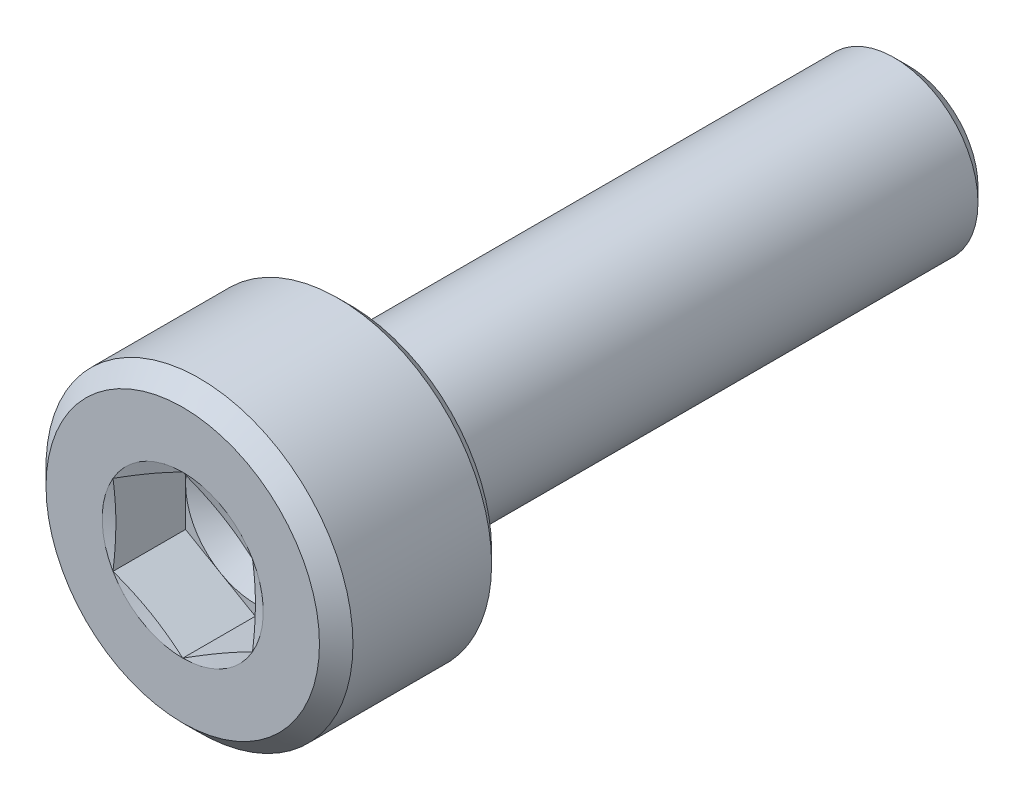
ISO-10303-21;
HEADER;
FILE_DESCRIPTION(('STEP AP214'),'2;1');
FILE_NAME('part.step','',(''),(''),'','','');
FILE_SCHEMA(('AUTOMOTIVE_DESIGN { 1 0 10303 214 1 1 1 1 }'));
ENDSEC;
DATA;
#1=APPLICATION_CONTEXT('core data for automotive mechanical design processes');
#2=APPLICATION_PROTOCOL_DEFINITION('international standard','automotive_design',2000,#1);
#3=PRODUCT_CONTEXT('',#1,'mechanical');
#4=PRODUCT('Part','Part','',(#3));
#5=PRODUCT_RELATED_PRODUCT_CATEGORY('part','',(#4));
#6=PRODUCT_DEFINITION_FORMATION('','',#4);
#7=PRODUCT_DEFINITION_CONTEXT('part definition',#1,'design');
#8=PRODUCT_DEFINITION('design','',#6,#7);
#9=PRODUCT_DEFINITION_SHAPE('','',#8);
#10=(LENGTH_UNIT() NAMED_UNIT(*) SI_UNIT(.MILLI.,.METRE.));
#11=(NAMED_UNIT(*) PLANE_ANGLE_UNIT() SI_UNIT($,.RADIAN.));
#12=(NAMED_UNIT(*) SI_UNIT($,.STERADIAN.) SOLID_ANGLE_UNIT());
#13=UNCERTAINTY_MEASURE_WITH_UNIT(LENGTH_MEASURE(1.E-05),#10,'distance_accuracy_value','');
#14=(GEOMETRIC_REPRESENTATION_CONTEXT(3) GLOBAL_UNCERTAINTY_ASSIGNED_CONTEXT((#13)) GLOBAL_UNIT_ASSIGNED_CONTEXT((#10,
#11,#12)) REPRESENTATION_CONTEXT('',''));
#15=CARTESIAN_POINT('',(0.,0.,0.));
#16=DIRECTION('',(0.,0.,1.));
#17=DIRECTION('',(1.,0.,0.));
#18=AXIS2_PLACEMENT_3D('',#15,#16,#17);
#19=CARTESIAN_POINT('',(0.,0.,0.));
#20=DIRECTION('',(0.,0.,-1.));
#21=DIRECTION('',(-1.,0.,0.));
#22=AXIS2_PLACEMENT_3D('',#19,#20,#21);
#23=PLANE('',#22);
#24=CARTESIAN_POINT('',(0.,0.,0.));
#25=DIRECTION('',(0.,0.,1.));
#26=DIRECTION('',(1.,0.,0.));
#27=AXIS2_PLACEMENT_3D('',#24,#25,#26);
#28=CIRCLE('',#27,2.44999999999999);
#29=CARTESIAN_POINT('',(2.44999999999999,0.,0.));
#30=VERTEX_POINT('',#29);
#31=EDGE_CURVE('E230',#30,#30,#28,.T.);
#32=ORIENTED_EDGE('',*,*,#31,.T.);
#33=EDGE_LOOP('',(#32));
#34=FACE_BOUND('',#33,.T.);
#35=CARTESIAN_POINT('',(0.,0.,0.));
#36=DIRECTION('',(0.,0.,1.));
#37=DIRECTION('',(1.,0.,0.));
#38=AXIS2_PLACEMENT_3D('',#35,#36,#37);
#39=CIRCLE('',#38,1.44337567297407);
#40=CARTESIAN_POINT('',(-1.25,-0.721687836487033,0.));
#41=VERTEX_POINT('',#40);
#42=CARTESIAN_POINT('',(0.,-1.44337567297407,0.));
#43=VERTEX_POINT('',#42);
#44=EDGE_CURVE('E156',#41,#43,#39,.T.);
#45=ORIENTED_EDGE('',*,*,#44,.F.);
#46=CARTESIAN_POINT('',(-1.25,0.721687836487033,0.));
#47=VERTEX_POINT('',#46);
#48=EDGE_CURVE('E155',#47,#41,#39,.T.);
#49=ORIENTED_EDGE('',*,*,#48,.F.);
#50=CARTESIAN_POINT('',(0.,1.44337567297407,0.));
#51=VERTEX_POINT('',#50);
#52=EDGE_CURVE('E122',#51,#47,#39,.T.);
#53=ORIENTED_EDGE('',*,*,#52,.F.);
#54=CARTESIAN_POINT('',(1.25,0.721687836487034,0.));
#55=VERTEX_POINT('',#54);
#56=EDGE_CURVE('E116',#55,#51,#39,.T.);
#57=ORIENTED_EDGE('',*,*,#56,.F.);
#58=CARTESIAN_POINT('',(1.25,-0.721687836487031,0.));
#59=VERTEX_POINT('',#58);
#60=EDGE_CURVE('E124',#59,#55,#39,.T.);
#61=ORIENTED_EDGE('',*,*,#60,.F.);
#62=EDGE_CURVE('E314',#43,#59,#39,.T.);
#63=ORIENTED_EDGE('',*,*,#62,.F.);
#64=EDGE_LOOP('',(#45,#49,#53,#57,#61,#63));
#65=FACE_BOUND('',#64,.T.);
#66=ADVANCED_FACE('F39',(#34,#65),#23,.F.);
#67=CARTESIAN_POINT('',(0.,0.,-0.3));
#68=DIRECTION('',(0.,0.,-1.));
#69=DIRECTION('',(-1.,0.,0.));
#70=AXIS2_PLACEMENT_3D('',#67,#68,#69);
#71=CONICAL_SURFACE('',#70,2.75,0.78539816339746);
#72=ORIENTED_EDGE('',*,*,#31,.F.);
#73=EDGE_LOOP('',(#72));
#74=FACE_BOUND('',#73,.T.);
#75=CARTESIAN_POINT('',(0.,0.,-0.3));
#76=DIRECTION('',(0.,0.,1.));
#77=DIRECTION('',(1.,0.,0.));
#78=AXIS2_PLACEMENT_3D('',#75,#76,#77);
#79=CIRCLE('',#78,2.75);
#80=CARTESIAN_POINT('',(2.75,0.,-0.3));
#81=VERTEX_POINT('',#80);
#82=EDGE_CURVE('E232',#81,#81,#79,.T.);
#83=ORIENTED_EDGE('',*,*,#82,.T.);
#84=EDGE_LOOP('',(#83));
#85=FACE_BOUND('',#84,.T.);
#86=ADVANCED_FACE('F221',(#74,#85),#71,.T.);
#87=CARTESIAN_POINT('',(0.,0.,0.));
#88=DIRECTION('',(0.,0.,1.));
#89=DIRECTION('',(1.,0.,0.));
#90=AXIS2_PLACEMENT_3D('',#87,#88,#89);
#91=CYLINDRICAL_SURFACE('',#90,2.75);
#92=ORIENTED_EDGE('',*,*,#82,.F.);
#93=EDGE_LOOP('',(#92));
#94=FACE_BOUND('',#93,.T.);
#95=CARTESIAN_POINT('',(0.,0.,-2.785));
#96=DIRECTION('',(0.,0.,1.));
#97=DIRECTION('',(1.,0.,0.));
#98=AXIS2_PLACEMENT_3D('',#95,#96,#97);
#99=CIRCLE('',#98,2.75);
#100=CARTESIAN_POINT('',(2.75,0.,-2.785));
#101=VERTEX_POINT('',#100);
#102=EDGE_CURVE('E235',#101,#101,#99,.T.);
#103=ORIENTED_EDGE('',*,*,#102,.T.);
#104=EDGE_LOOP('',(#103));
#105=FACE_BOUND('',#104,.T.);
#106=ADVANCED_FACE('F226',(#94,#105),#91,.T.);
#107=CARTESIAN_POINT('',(0.,0.,-3.));
#108=DIRECTION('',(0.,0.,1.));
#109=DIRECTION('',(1.,0.,0.));
#110=AXIS2_PLACEMENT_3D('',#107,#108,#109);
#111=CONICAL_SURFACE('',#110,2.535,0.785398163397449);
#112=ORIENTED_EDGE('',*,*,#102,.F.);
#113=EDGE_LOOP('',(#112));
#114=FACE_BOUND('',#113,.T.);
#115=CARTESIAN_POINT('',(0.,0.,-3.));
#116=DIRECTION('',(0.,0.,1.));
#117=DIRECTION('',(1.,0.,0.));
#118=AXIS2_PLACEMENT_3D('',#115,#116,#117);
#119=CIRCLE('',#118,2.535);
#120=CARTESIAN_POINT('',(2.535,0.,-3.));
#121=VERTEX_POINT('',#120);
#122=EDGE_CURVE('E240',#121,#121,#119,.T.);
#123=ORIENTED_EDGE('',*,*,#122,.T.);
#124=EDGE_LOOP('',(#123));
#125=FACE_BOUND('',#124,.T.);
#126=ADVANCED_FACE('F430',(#114,#125),#111,.T.);
#127=CARTESIAN_POINT('',(0.,2.535,-3.));
#128=DIRECTION('',(0.,0.,1.));
#129=DIRECTION('',(1.,0.,0.));
#130=AXIS2_PLACEMENT_3D('',#127,#128,#129);
#131=PLANE('',#130);
#132=ORIENTED_EDGE('',*,*,#122,.F.);
#133=EDGE_LOOP('',(#132));
#134=FACE_BOUND('',#133,.T.);
#135=CARTESIAN_POINT('',(0.,0.,-3.));
#136=DIRECTION('',(0.,0.,1.));
#137=DIRECTION('',(1.,0.,0.));
#138=AXIS2_PLACEMENT_3D('',#135,#136,#137);
#139=CIRCLE('',#138,1.8);
#140=CARTESIAN_POINT('',(1.8,0.,-3.));
#141=VERTEX_POINT('',#140);
#142=EDGE_CURVE('E243',#141,#141,#139,.T.);
#143=ORIENTED_EDGE('',*,*,#142,.T.);
#144=EDGE_LOOP('',(#143));
#145=FACE_BOUND('',#144,.T.);
#146=ADVANCED_FACE('F422',(#134,#145),#131,.F.);
#147=CARTESIAN_POINT('',(0.,0.,-3.1));
#148=DIRECTION('',(0.,0.,1.));
#149=DIRECTION('',(1.,0.,0.));
#150=AXIS2_PLACEMENT_3D('',#147,#148,#149);
#151=TOROIDAL_SURFACE('',#150,1.8,0.1);
#152=ORIENTED_EDGE('',*,*,#142,.F.);
#153=EDGE_LOOP('',(#152));
#154=FACE_BOUND('',#153,.T.);
#155=CARTESIAN_POINT('',(0.,0.,-3.05615763679786));
#156=DIRECTION('',(0.,0.,1.));
#157=DIRECTION('',(1.,0.,0.));
#158=AXIS2_PLACEMENT_3D('',#155,#156,#157);
#159=CIRCLE('',#158,1.71012315543561);
#160=CARTESIAN_POINT('',(1.71012315543561,0.,-3.05615763679786));
#161=VERTEX_POINT('',#160);
#162=EDGE_CURVE('E246',#161,#161,#159,.T.);
#163=ORIENTED_EDGE('',*,*,#162,.T.);
#164=EDGE_LOOP('',(#163));
#165=FACE_BOUND('',#164,.T.);
#166=ADVANCED_FACE('F414',(#154,#165),#151,.F.);
#167=CARTESIAN_POINT('',(0.,0.,-3.46615763679786));
#168=DIRECTION('',(0.,0.,1.));
#169=DIRECTION('',(1.,0.,0.));
#170=AXIS2_PLACEMENT_3D('',#167,#168,#169);
#171=CONICAL_SURFACE('',#170,1.51012315543561,0.453844001521511);
#172=ORIENTED_EDGE('',*,*,#162,.F.);
#173=EDGE_LOOP('',(#172));
#174=FACE_BOUND('',#173,.T.);
#175=CARTESIAN_POINT('',(0.,0.,-3.46615763679786));
#176=DIRECTION('',(0.,0.,1.));
#177=DIRECTION('',(1.,0.,0.));
#178=AXIS2_PLACEMENT_3D('',#175,#176,#177);
#179=CIRCLE('',#178,1.51012315543561);
#180=CARTESIAN_POINT('',(1.51012315543561,0.,-3.46615763679786));
#181=VERTEX_POINT('',#180);
#182=EDGE_CURVE('E249',#181,#181,#179,.T.);
#183=ORIENTED_EDGE('',*,*,#182,.T.);
#184=EDGE_LOOP('',(#183));
#185=FACE_BOUND('',#184,.T.);
#186=ADVANCED_FACE('F406',(#174,#185),#171,.T.);
#187=CARTESIAN_POINT('',(0.,0.,-3.51));
#188=DIRECTION('',(0.,0.,1.));
#189=DIRECTION('',(1.,0.,0.));
#190=AXIS2_PLACEMENT_3D('',#187,#188,#189);
#191=TOROIDAL_SURFACE('',#190,1.6,0.1);
#192=ORIENTED_EDGE('',*,*,#182,.F.);
#193=EDGE_LOOP('',(#192));
#194=FACE_BOUND('',#193,.T.);
#195=CARTESIAN_POINT('',(0.,0.,-3.51));
#196=DIRECTION('',(0.,0.,1.));
#197=DIRECTION('',(1.,0.,0.));
#198=AXIS2_PLACEMENT_3D('',#195,#196,#197);
#199=CIRCLE('',#198,1.5);
#200=CARTESIAN_POINT('',(1.5,0.,-3.51));
#201=VERTEX_POINT('',#200);
#202=EDGE_CURVE('E252',#201,#201,#199,.T.);
#203=ORIENTED_EDGE('',*,*,#202,.T.);
#204=EDGE_LOOP('',(#203));
#205=FACE_BOUND('',#204,.T.);
#206=ADVANCED_FACE('F398',(#194,#205),#191,.F.);
#207=CARTESIAN_POINT('',(0.,0.,0.));
#208=DIRECTION('',(0.,0.,1.));
#209=DIRECTION('',(1.,0.,0.));
#210=AXIS2_PLACEMENT_3D('',#207,#208,#209);
#211=CYLINDRICAL_SURFACE('',#210,1.5);
#212=ORIENTED_EDGE('',*,*,#202,.F.);
#213=EDGE_LOOP('',(#212));
#214=FACE_BOUND('',#213,.T.);
#215=CARTESIAN_POINT('',(0.,0.,-12.75));
#216=DIRECTION('',(0.,0.,1.));
#217=DIRECTION('',(1.,0.,0.));
#218=AXIS2_PLACEMENT_3D('',#215,#216,#217);
#219=CIRCLE('',#218,1.5);
#220=CARTESIAN_POINT('',(1.5,0.,-12.75));
#221=VERTEX_POINT('',#220);
#222=EDGE_CURVE('E255',#221,#221,#219,.T.);
#223=ORIENTED_EDGE('',*,*,#222,.T.);
#224=EDGE_LOOP('',(#223));
#225=FACE_BOUND('',#224,.T.);
#226=ADVANCED_FACE('F389',(#214,#225),#211,.T.);
#227=CARTESIAN_POINT('',(0.,0.,-13.));
#228=DIRECTION('',(0.,0.,1.));
#229=DIRECTION('',(1.,0.,0.));
#230=AXIS2_PLACEMENT_3D('',#227,#228,#229);
#231=CONICAL_SURFACE('',#230,1.25,0.785398163397434);
#232=ORIENTED_EDGE('',*,*,#222,.F.);
#233=EDGE_LOOP('',(#232));
#234=FACE_BOUND('',#233,.T.);
#235=CARTESIAN_POINT('',(0.,0.,-13.));
#236=DIRECTION('',(0.,0.,1.));
#237=DIRECTION('',(1.,0.,0.));
#238=AXIS2_PLACEMENT_3D('',#235,#236,#237);
#239=CIRCLE('',#238,1.25);
#240=CARTESIAN_POINT('',(1.25,0.,-13.));
#241=VERTEX_POINT('',#240);
#242=EDGE_CURVE('E258',#241,#241,#239,.T.);
#243=ORIENTED_EDGE('',*,*,#242,.T.);
#244=EDGE_LOOP('',(#243));
#245=FACE_BOUND('',#244,.T.);
#246=ADVANCED_FACE('F381',(#234,#245),#231,.T.);
#247=CARTESIAN_POINT('',(0.,1.25,-13.));
#248=DIRECTION('',(0.,0.,1.));
#249=DIRECTION('',(1.,0.,0.));
#250=AXIS2_PLACEMENT_3D('',#247,#248,#249);
#251=PLANE('',#250);
#252=ORIENTED_EDGE('',*,*,#242,.F.);
#253=EDGE_LOOP('',(#252));
#254=FACE_BOUND('',#253,.T.);
#255=ADVANCED_FACE('F375',(#254),#251,.F.);
#256=CARTESIAN_POINT('',(0.,0.,-0.0518148554092243));
#257=DIRECTION('',(0.,0.,1.));
#258=DIRECTION('',(1.,0.,0.));
#259=AXIS2_PLACEMENT_3D('',#256,#257,#258);
#260=CONICAL_SURFACE('',#259,1.25,1.30899693899575);
#261=ORIENTED_EDGE('',*,*,#52,.T.);
#262=CARTESIAN_POINT('',(-1.2502,0.721572366433195,3.09438201916871E-05));
#263=CARTESIAN_POINT('',(-1.19827409383526,0.751551802335321,-0.00800698378926622));
#264=CARTESIAN_POINT('',(-1.14625401362102,0.781585609650283,-0.0153042105125454));
#265=CARTESIAN_POINT('',(-1.04203006351459,0.841759335300235,-0.0281248924452036));
#266=CARTESIAN_POINT('',(-0.989826127596593,0.871899291755248,-0.0336476265269101));
#267=CARTESIAN_POINT('',(-0.88555111655682,0.932102497448812,-0.0425967858491088));
#268=CARTESIAN_POINT('',(-0.833480747184869,0.962165339222511,-0.0460338877791617));
#269=CARTESIAN_POINT('',(-0.729273575326724,1.0223293779463,-0.0506427032068));
#270=CARTESIAN_POINT('',(-0.677136787663362,1.05243056633842,-0.0518148554092241));
#271=CARTESIAN_POINT('',(-0.572863212336638,1.11263294312267,-0.0518148554092241));
#272=CARTESIAN_POINT('',(-0.520726424673275,1.1427341315148,-0.0506427032068001));
#273=CARTESIAN_POINT('',(-0.416519252815131,1.20289817023859,-0.0460338877791617));
#274=CARTESIAN_POINT('',(-0.36444888344318,1.23296101201229,-0.0425967858491088));
#275=CARTESIAN_POINT('',(-0.260173872403407,1.29316421770585,-0.03364762652691));
#276=CARTESIAN_POINT('',(-0.207969936485411,1.32330417416086,-0.0281248924452036));
#277=CARTESIAN_POINT('',(-0.103745986378985,1.38347789981082,-0.0153042105125453));
#278=CARTESIAN_POINT('',(-0.0517259061647358,1.41351170712578,-0.00800698378926612));
#279=CARTESIAN_POINT('',(0.00020000000000038,1.4434911430279,3.09438201918299E-05));
#280=B_SPLINE_CURVE_WITH_KNOTS('',3,(#262,#263,#264,#265,#266,#267,#268,#269,#270,#271,#272,
#273,#274,#275,#276,#277,#278,#279),.UNSPECIFIED.,.F.,.F.,(4,2,2,2,2,2,2,2,4),(0.,
0.18149525192516,0.363064167833313,0.543695584294992,0.724292010212745,0.9048884361305,
1.08551985259218,1.26708876850033,1.44858402042549),.UNSPECIFIED.);
#281=EDGE_CURVE('E11',#47,#51,#280,.T.);
#282=ORIENTED_EDGE('',*,*,#281,.T.);
#283=EDGE_LOOP('',(#261,#282));
#284=FACE_BOUND('',#283,.T.);
#285=ADVANCED_FACE('F128',(#284),#260,.F.);
#286=CARTESIAN_POINT('',(-1.25,-1.90803764372689,0.224449375411132));
#287=CARTESIAN_POINT('',(-1.25,-1.8513410457493,0.21174373926854));
#288=CARTESIAN_POINT('',(-1.25,-1.79460907964503,0.199195804458375));
#289=CARTESIAN_POINT('',(-1.25,-1.68105673477474,0.174495010900465));
#290=CARTESIAN_POINT('',(-1.25,-1.62423635229394,0.162342169249333));
#291=CARTESIAN_POINT('',(-1.25,-1.4535135757121,0.126574423752231));
#292=CARTESIAN_POINT('',(-1.25,-1.33945900339908,0.103675151182616));
#293=CARTESIAN_POINT('',(-1.25,-1.11170727260793,0.0609587630346281));
#294=CARTESIAN_POINT('',(-1.25,-0.998014548362105,0.0411184667683871));
#295=CARTESIAN_POINT('',(-1.25,-0.769948454688276,0.00583266905587686));
#296=CARTESIAN_POINT('',(-1.25,-0.655575207287998,-0.00961359741797872));
#297=CARTESIAN_POINT('',(-1.25,-0.424787181644499,-0.0341426384914952));
#298=CARTESIAN_POINT('',(-1.25,-0.308363938645654,-0.0431515305449703));
#299=CARTESIAN_POINT('',(-1.25,-0.133499226938177,-0.0502674214127566));
#300=CARTESIAN_POINT('',(-1.25,-0.0751823293286765,-0.0515734559811251));
#301=CARTESIAN_POINT('',(-1.25,0.0414593912908041,-0.0519953132862497));
#302=CARTESIAN_POINT('',(-1.25,0.0997842142946219,-0.0511111377164467));
#303=CARTESIAN_POINT('',(-1.25,0.275064939261687,-0.0452058780708578));
#304=CARTESIAN_POINT('',(-1.25,0.391917619612776,-0.0369155048717787));
#305=CARTESIAN_POINT('',(-1.25,0.624955711707257,-0.013420604100275));
#306=CARTESIAN_POINT('',(-1.25,0.741140574853819,0.00178895996036897));
#307=CARTESIAN_POINT('',(-1.25,0.965009686747211,0.0357098573203466));
#308=CARTESIAN_POINT('',(-1.25,1.07274149713457,0.0541179629895213));
#309=CARTESIAN_POINT('',(-1.25,1.28770836040789,0.0936619087242774));
#310=CARTESIAN_POINT('',(-1.25,1.39494334881407,0.114798093117207));
#311=CARTESIAN_POINT('',(-1.25,1.60905523406172,0.158897571848756));
#312=CARTESIAN_POINT('',(-1.25,1.71593205434096,0.181861233731142));
#313=CARTESIAN_POINT('',(-1.25,1.92941059122614,0.229035853527515));
#314=CARTESIAN_POINT('',(-1.25,2.0360123020935,0.253246837242345));
#315=CARTESIAN_POINT('',(-1.25,2.24796149236902,0.302300913060499));
#316=CARTESIAN_POINT('',(-1.25,2.35331096915779,0.32713541151495));
#317=CARTESIAN_POINT('',(-1.25,2.56386296226419,0.377426560036597));
#318=CARTESIAN_POINT('',(-1.25,2.66906547587909,0.402883221390532));
#319=CARTESIAN_POINT('',(-1.25,2.87922866754162,0.454224569867166));
#320=CARTESIAN_POINT('',(-1.25,2.98418948388924,0.4801086920956));
#321=CARTESIAN_POINT('',(-1.25,3.19401964928918,0.53223064686748));
#322=CARTESIAN_POINT('',(-1.25,3.29888900123911,0.558468467737611));
#323=CARTESIAN_POINT('',(-1.25,3.40372646605654,0.5848316076134));
#324=B_SPLINE_CURVE_WITH_KNOTS('',3,(#286,#287,#288,#289,#290,#291,#292,#293,#294,#295,#296,
#297,#298,#299,#300,#301,#302,#303,#304,#305,#306,#307,#308,#309,#310,#311,#312,#313,#314,#315,
#316,#317,#318,#319,#320,#321,#322,#323),.UNSPECIFIED.,.F.,.F.,(4,2,2,2,2,2,2,2,2,2,2,2,2,2,2,2,
2,2,4),(0.,0.17430798332962,0.348623499364559,0.697591208701206,1.04376859165833,
1.38988566606611,1.73991400543005,1.91487041156219,2.08982668242046,2.44096537417444,
2.79236007022679,3.12019018011378,3.44806170796195,3.77599934506425,4.10394376827983,
4.4286525086615,4.75336714400545,5.07768244044904,5.40198705941089),.UNSPECIFIED.);
#325=EDGE_CURVE('E121',#41,#47,#324,.T.);
#326=ORIENTED_EDGE('',*,*,#325,.T.);
#327=ORIENTED_EDGE('',*,*,#48,.T.);
#328=EDGE_LOOP('',(#326,#327));
#329=FACE_BOUND('',#328,.T.);
#330=ADVANCED_FACE('F362',(#329),#260,.F.);
#331=CARTESIAN_POINT('',(0.000199999999999765,-1.4434911430279,3.09438201913897E-05));
#332=CARTESIAN_POINT('',(-0.0517259061647364,-1.41351170712578,-0.0080069837892665));
#333=CARTESIAN_POINT('',(-0.103745986378985,-1.38347789981081,-0.0153042105125457));
#334=CARTESIAN_POINT('',(-0.207969936485412,-1.32330417416086,-0.028124892445204));
#335=CARTESIAN_POINT('',(-0.260173872403408,-1.29316421770585,-0.0336476265269104));
#336=CARTESIAN_POINT('',(-0.36444888344318,-1.23296101201229,-0.0425967858491091));
#337=CARTESIAN_POINT('',(-0.416519252815131,-1.20289817023859,-0.046033887779162));
#338=CARTESIAN_POINT('',(-0.520726424673276,-1.1427341315148,-0.0506427032068003));
#339=CARTESIAN_POINT('',(-0.572863212336638,-1.11263294312267,-0.0518148554092244));
#340=CARTESIAN_POINT('',(-0.677136787663362,-1.05243056633842,-0.0518148554092244));
#341=CARTESIAN_POINT('',(-0.729273575326725,-1.0223293779463,-0.0506427032068003));
#342=CARTESIAN_POINT('',(-0.833480747184869,-0.962165339222509,-0.046033887779162));
#343=CARTESIAN_POINT('',(-0.88555111655682,-0.93210249744881,-0.0425967858491091));
#344=CARTESIAN_POINT('',(-0.989826127596593,-0.871899291755246,-0.0336476265269103));
#345=CARTESIAN_POINT('',(-1.04203006351459,-0.841759335300233,-0.0281248924452038));
#346=CARTESIAN_POINT('',(-1.14625401362102,-0.781585609650282,-0.0153042105125455));
#347=CARTESIAN_POINT('',(-1.19827409383526,-0.75155180233532,-0.00800698378926632));
#348=CARTESIAN_POINT('',(-1.2502,-0.721572366433194,3.09438201915463E-05));
#349=B_SPLINE_CURVE_WITH_KNOTS('',3,(#331,#332,#333,#334,#335,#336,#337,#338,#339,#340,#341,
#342,#343,#344,#345,#346,#347,#348),.UNSPECIFIED.,.F.,.F.,(4,2,2,2,2,2,2,2,4),(0.,
0.18149525192516,0.363064167833313,0.543695584294991,0.724292010212745,0.904888436130499,
1.08551985259218,1.26708876850033,1.44858402042549),.UNSPECIFIED.);
#350=EDGE_CURVE('E164',#43,#41,#349,.T.);
#351=ORIENTED_EDGE('',*,*,#350,.T.);
#352=ORIENTED_EDGE('',*,*,#44,.T.);
#353=EDGE_LOOP('',(#351,#352));
#354=FACE_BOUND('',#353,.T.);
#355=ADVANCED_FACE('F356',(#354),#260,.F.);
#356=CARTESIAN_POINT('',(1.2502,-0.721572366433195,3.09438201914613E-05));
#357=CARTESIAN_POINT('',(1.19827409383526,-0.75155180233532,-0.00800698378926647));
#358=CARTESIAN_POINT('',(1.14625401362101,-0.781585609650283,-0.0153042105125457));
#359=CARTESIAN_POINT('',(1.04203006351459,-0.841759335300234,-0.0281248924452039));
#360=CARTESIAN_POINT('',(0.989826127596592,-0.871899291755247,-0.0336476265269103));
#361=CARTESIAN_POINT('',(0.88555111655682,-0.932102497448811,-0.042596785849109));
#362=CARTESIAN_POINT('',(0.833480747184869,-0.96216533922251,-0.046033887779162));
#363=CARTESIAN_POINT('',(0.729273575326724,-1.0223293779463,-0.0506427032068003));
#364=CARTESIAN_POINT('',(0.677136787663362,-1.05243056633842,-0.0518148554092244));
#365=CARTESIAN_POINT('',(0.572863212336637,-1.11263294312267,-0.0518148554092244));
#366=CARTESIAN_POINT('',(0.520726424673275,-1.1427341315148,-0.0506427032068003));
#367=CARTESIAN_POINT('',(0.416519252815131,-1.20289817023859,-0.046033887779162));
#368=CARTESIAN_POINT('',(0.36444888344318,-1.23296101201229,-0.042596785849109));
#369=CARTESIAN_POINT('',(0.260173872403407,-1.29316421770585,-0.0336476265269103));
#370=CARTESIAN_POINT('',(0.207969936485411,-1.32330417416086,-0.028124892445204));
#371=CARTESIAN_POINT('',(0.103745986378985,-1.38347789981081,-0.0153042105125458));
#372=CARTESIAN_POINT('',(0.0517259061647362,-1.41351170712578,-0.00800698378926656));
#373=CARTESIAN_POINT('',(-0.000200000000000036,-1.4434911430279,3.09438201914066E-05));
#374=B_SPLINE_CURVE_WITH_KNOTS('',3,(#356,#357,#358,#359,#360,#361,#362,#363,#364,#365,#366,
#367,#368,#369,#370,#371,#372,#373),.UNSPECIFIED.,.F.,.F.,(4,2,2,2,2,2,2,2,4),(0.,
0.18149525192516,0.363064167833312,0.543695584294991,0.724292010212745,0.904888436130499,
1.08551985259218,1.26708876850033,1.44858402042549),.UNSPECIFIED.);
#375=EDGE_CURVE('E184',#59,#43,#374,.T.);
#376=ORIENTED_EDGE('',*,*,#375,.T.);
#377=ORIENTED_EDGE('',*,*,#62,.T.);
#378=EDGE_LOOP('',(#376,#377));
#379=FACE_BOUND('',#378,.T.);
#380=ADVANCED_FACE('F350',(#379),#260,.F.);
#381=CARTESIAN_POINT('',(1.25,-1.90803764372689,0.224449375411132));
#382=CARTESIAN_POINT('',(1.25,-1.8513410457493,0.21174373926854));
#383=CARTESIAN_POINT('',(1.25,-1.79460907964503,0.199195804458375));
#384=CARTESIAN_POINT('',(1.25,-1.68105673477474,0.174495010900465));
#385=CARTESIAN_POINT('',(1.25,-1.62423635229394,0.162342169249333));
#386=CARTESIAN_POINT('',(1.25,-1.4535135757121,0.126574423752231));
#387=CARTESIAN_POINT('',(1.25,-1.33945900339908,0.103675151182616));
#388=CARTESIAN_POINT('',(1.25,-1.11170727260793,0.0609587630346278));
#389=CARTESIAN_POINT('',(1.25,-0.998014548362105,0.0411184667683869));
#390=CARTESIAN_POINT('',(1.25,-0.769948454688276,0.00583266905587672));
#391=CARTESIAN_POINT('',(1.25,-0.655575207287999,-0.00961359741797884));
#392=CARTESIAN_POINT('',(1.25,-0.4247871816445,-0.0341426384914953));
#393=CARTESIAN_POINT('',(1.25,-0.308363938645655,-0.0431515305449704));
#394=CARTESIAN_POINT('',(1.25,-0.133499226938178,-0.0502674214127568));
#395=CARTESIAN_POINT('',(1.25,-0.0751823293286781,-0.0515734559811252));
#396=CARTESIAN_POINT('',(1.25,0.0414593912908024,-0.0519953132862499));
#397=CARTESIAN_POINT('',(1.25,0.0997842142946203,-0.0511111377164469));
#398=CARTESIAN_POINT('',(1.25,0.275064939261685,-0.045205878070858));
#399=CARTESIAN_POINT('',(1.25,0.391917619612775,-0.036915504871779));
#400=CARTESIAN_POINT('',(1.25,0.624955711707256,-0.0134206041002753));
#401=CARTESIAN_POINT('',(1.25,0.741140574853817,0.00178895996036867));
#402=CARTESIAN_POINT('',(1.25,0.96500968674721,0.0357098573203462));
#403=CARTESIAN_POINT('',(1.25,1.07274149713457,0.054117962989521));
#404=CARTESIAN_POINT('',(1.25,1.28770836040789,0.093661908724277));
#405=CARTESIAN_POINT('',(1.25,1.39494334881407,0.114798093117207));
#406=CARTESIAN_POINT('',(1.25,1.60905523406172,0.158897571848756));
#407=CARTESIAN_POINT('',(1.25,1.71593205434096,0.181861233731142));
#408=CARTESIAN_POINT('',(1.25,1.92941059122614,0.229035853527516));
#409=CARTESIAN_POINT('',(1.25,2.0360123020935,0.253246837242345));
#410=CARTESIAN_POINT('',(1.25,2.24796149236902,0.302300913060499));
#411=CARTESIAN_POINT('',(1.25,2.35331096915779,0.32713541151495));
#412=CARTESIAN_POINT('',(1.25,2.56386296226419,0.377426560036597));
#413=CARTESIAN_POINT('',(1.25,2.66906547587909,0.402883221390532));
#414=CARTESIAN_POINT('',(1.25,2.87922866754162,0.454224569867166));
#415=CARTESIAN_POINT('',(1.25,2.98418948388924,0.4801086920956));
#416=CARTESIAN_POINT('',(1.25,3.19401964928918,0.53223064686748));
#417=CARTESIAN_POINT('',(1.25,3.29888900123911,0.558468467737611));
#418=CARTESIAN_POINT('',(1.25,3.40372646605654,0.5848316076134));
#419=B_SPLINE_CURVE_WITH_KNOTS('',3,(#381,#382,#383,#384,#385,#386,#387,#388,#389,#390,#391,
#392,#393,#394,#395,#396,#397,#398,#399,#400,#401,#402,#403,#404,#405,#406,#407,#408,#409,#410,
#411,#412,#413,#414,#415,#416,#417,#418),.UNSPECIFIED.,.F.,.F.,(4,2,2,2,2,2,2,2,2,2,2,2,2,2,2,2,
2,2,4),(0.,0.17430798332962,0.348623499364559,0.697591208701206,1.04376859165833,
1.38988566606611,1.73991400543005,1.91487041156219,2.08982668242046,2.44096537417444,
2.79236007022679,3.12019018011378,3.44806170796195,3.77599934506425,4.10394376827983,
4.4286525086615,4.75336714400545,5.07768244044904,5.40198705941089),.UNSPECIFIED.);
#420=EDGE_CURVE('E64',#55,#59,#419,.F.);
#421=ORIENTED_EDGE('',*,*,#420,.T.);
#422=ORIENTED_EDGE('',*,*,#60,.T.);
#423=EDGE_LOOP('',(#421,#422));
#424=FACE_BOUND('',#423,.T.);
#425=ADVANCED_FACE('F177',(#424),#260,.F.);
#426=CARTESIAN_POINT('',(-0.000199999999999885,1.4434911430279,3.09438201917452E-05));
#427=CARTESIAN_POINT('',(0.0517259061647365,1.41351170712578,-0.00800698378926616));
#428=CARTESIAN_POINT('',(0.103745986378985,1.38347789981081,-0.0153042105125454));
#429=CARTESIAN_POINT('',(0.207969936485411,1.32330417416086,-0.0281248924452036));
#430=CARTESIAN_POINT('',(0.260173872403408,1.29316421770585,-0.03364762652691));
#431=CARTESIAN_POINT('',(0.36444888344318,1.23296101201229,-0.0425967858491087));
#432=CARTESIAN_POINT('',(0.416519252815131,1.20289817023859,-0.0460338877791617));
#433=CARTESIAN_POINT('',(0.520726424673275,1.1427341315148,-0.0506427032068));
#434=CARTESIAN_POINT('',(0.572863212336638,1.11263294312267,-0.0518148554092241));
#435=CARTESIAN_POINT('',(0.677136787663362,1.05243056633842,-0.0518148554092242));
#436=CARTESIAN_POINT('',(0.729273575326724,1.0223293779463,-0.0506427032068001));
#437=CARTESIAN_POINT('',(0.833480747184869,0.962165339222511,-0.0460338877791617));
#438=CARTESIAN_POINT('',(0.88555111655682,0.932102497448812,-0.0425967858491088));
#439=CARTESIAN_POINT('',(0.989826127596592,0.871899291755248,-0.0336476265269101));
#440=CARTESIAN_POINT('',(1.04203006351459,0.841759335300235,-0.0281248924452037));
#441=CARTESIAN_POINT('',(1.14625401362101,0.781585609650283,-0.0153042105125454));
#442=CARTESIAN_POINT('',(1.19827409383526,0.751551802335321,-0.00800698378926624));
#443=CARTESIAN_POINT('',(1.2502,0.721572366433195,3.09438201916591E-05));
#444=B_SPLINE_CURVE_WITH_KNOTS('',3,(#426,#427,#428,#429,#430,#431,#432,#433,#434,#435,#436,
#437,#438,#439,#440,#441,#442,#443),.UNSPECIFIED.,.F.,.F.,(4,2,2,2,2,2,2,2,4),(0.,
0.18149525192516,0.363064167833313,0.543695584294991,0.724292010212745,0.904888436130499,
1.08551985259218,1.26708876850033,1.44858402042549),.UNSPECIFIED.);
#445=EDGE_CURVE('E58',#51,#55,#444,.T.);
#446=ORIENTED_EDGE('',*,*,#445,.T.);
#447=ORIENTED_EDGE('',*,*,#56,.T.);
#448=EDGE_LOOP('',(#446,#447));
#449=FACE_BOUND('',#448,.T.);
#450=ADVANCED_FACE('F117',(#449),#260,.F.);
#451=CARTESIAN_POINT('',(0.,0.,-2.02168783648703));
#452=DIRECTION('',(0.,0.,1.));
#453=DIRECTION('',(1.,0.,0.));
#454=AXIS2_PLACEMENT_3D('',#451,#452,#453);
#455=CONICAL_SURFACE('',#454,0.,1.0471975511966);
#456=CARTESIAN_POINT('',(0.,0.,-1.3));
#457=DIRECTION('',(0.,0.,1.));
#458=DIRECTION('',(1.,0.,0.));
#459=AXIS2_PLACEMENT_3D('',#456,#457,#458);
#460=CIRCLE('',#459,1.25);
#461=CARTESIAN_POINT('',(1.25,0.,-1.3));
#462=VERTEX_POINT('',#461);
#463=CARTESIAN_POINT('',(0.625,1.08253175473055,-1.3));
#464=VERTEX_POINT('',#463);
#465=EDGE_CURVE('E144',#462,#464,#460,.T.);
#466=ORIENTED_EDGE('',*,*,#465,.T.);
#467=CARTESIAN_POINT('',(-0.625,1.08253175473055,-1.3));
#468=VERTEX_POINT('',#467);
#469=EDGE_CURVE('E52',#464,#468,#460,.T.);
#470=ORIENTED_EDGE('',*,*,#469,.T.);
#471=CARTESIAN_POINT('',(-1.25,0.,-1.3));
#472=VERTEX_POINT('',#471);
#473=EDGE_CURVE('E295',#468,#472,#460,.T.);
#474=ORIENTED_EDGE('',*,*,#473,.T.);
#475=CARTESIAN_POINT('',(-0.625,-1.08253175473055,-1.3));
#476=VERTEX_POINT('',#475);
#477=EDGE_CURVE('E297',#472,#476,#460,.T.);
#478=ORIENTED_EDGE('',*,*,#477,.T.);
#479=CARTESIAN_POINT('',(0.624999999999999,-1.08253175473055,-1.3));
#480=VERTEX_POINT('',#479);
#481=EDGE_CURVE('E233',#476,#480,#460,.T.);
#482=ORIENTED_EDGE('',*,*,#481,.T.);
#483=EDGE_CURVE('E231',#480,#462,#460,.T.);
#484=ORIENTED_EDGE('',*,*,#483,.T.);
#485=EDGE_LOOP('',(#466,#470,#474,#478,#482,#484));
#486=FACE_BOUND('',#485,.T.);
#487=CARTESIAN_POINT('',(0.,0.,-2.02168783648703));
#488=VERTEX_POINT('',#487);
#489=VERTEX_LOOP('',#488);
#490=FACE_BOUND('',#489,.T.);
#491=ADVANCED_FACE('F176',(#486,#490),#455,.F.);
#492=CARTESIAN_POINT('',(0.,0.,-1.3));
#493=DIRECTION('',(0.,0.,1.));
#494=DIRECTION('',(1.,0.,0.));
#495=AXIS2_PLACEMENT_3D('',#492,#493,#494);
#496=PLANE('',#495);
#497=ORIENTED_EDGE('',*,*,#465,.F.);
#498=DIRECTION('',(0.,1.,0.));
#499=VECTOR('',#498,1.);
#500=CARTESIAN_POINT('',(1.25,-0.721687836487033,-1.3));
#501=LINE('',#500,#499);
#502=CARTESIAN_POINT('',(1.25,0.721687836487033,-1.3));
#503=VERTEX_POINT('',#502);
#504=EDGE_CURVE('E274',#462,#503,#501,.T.);
#505=ORIENTED_EDGE('',*,*,#504,.T.);
#506=DIRECTION('',(-0.866025403784439,0.5,0.));
#507=VECTOR('',#506,1.);
#508=CARTESIAN_POINT('',(1.25,0.721687836487033,-1.3));
#509=LINE('',#508,#507);
#510=EDGE_CURVE('E289',#503,#464,#509,.T.);
#511=ORIENTED_EDGE('',*,*,#510,.T.);
#512=EDGE_LOOP('',(#497,#505,#511));
#513=FACE_BOUND('',#512,.T.);
#514=ADVANCED_FACE('F319',(#513),#496,.T.);
#515=ORIENTED_EDGE('',*,*,#483,.F.);
#516=DIRECTION('',(0.866025403784439,0.5,0.));
#517=VECTOR('',#516,1.);
#518=CARTESIAN_POINT('',(0.,-1.44337567297406,-1.3));
#519=LINE('',#518,#517);
#520=CARTESIAN_POINT('',(1.25,-0.721687836487033,-1.3));
#521=VERTEX_POINT('',#520);
#522=EDGE_CURVE('E278',#480,#521,#519,.T.);
#523=ORIENTED_EDGE('',*,*,#522,.T.);
#524=EDGE_CURVE('E151',#521,#462,#501,.T.);
#525=ORIENTED_EDGE('',*,*,#524,.T.);
#526=EDGE_LOOP('',(#515,#523,#525));
#527=FACE_BOUND('',#526,.T.);
#528=ADVANCED_FACE('F207',(#527),#496,.T.);
#529=ORIENTED_EDGE('',*,*,#481,.F.);
#530=DIRECTION('',(0.866025403784439,-0.5,0.));
#531=VECTOR('',#530,1.);
#532=CARTESIAN_POINT('',(-1.25,-0.721687836487032,-1.3));
#533=LINE('',#532,#531);
#534=CARTESIAN_POINT('',(0.,-1.44337567297406,-1.3));
#535=VERTEX_POINT('',#534);
#536=EDGE_CURVE('E282',#476,#535,#533,.T.);
#537=ORIENTED_EDGE('',*,*,#536,.T.);
#538=EDGE_CURVE('E275',#535,#480,#519,.T.);
#539=ORIENTED_EDGE('',*,*,#538,.T.);
#540=EDGE_LOOP('',(#529,#537,#539));
#541=FACE_BOUND('',#540,.T.);
#542=ADVANCED_FACE('F310',(#541),#496,.T.);
#543=ORIENTED_EDGE('',*,*,#477,.F.);
#544=DIRECTION('',(0.,-1.,0.));
#545=VECTOR('',#544,1.);
#546=CARTESIAN_POINT('',(-1.25,0.721687836487033,-1.3));
#547=LINE('',#546,#545);
#548=CARTESIAN_POINT('',(-1.25,-0.721687836487032,-1.3));
#549=VERTEX_POINT('',#548);
#550=EDGE_CURVE('E286',#472,#549,#547,.T.);
#551=ORIENTED_EDGE('',*,*,#550,.T.);
#552=EDGE_CURVE('E279',#549,#476,#533,.T.);
#553=ORIENTED_EDGE('',*,*,#552,.T.);
#554=EDGE_LOOP('',(#543,#551,#553));
#555=FACE_BOUND('',#554,.T.);
#556=ADVANCED_FACE('F324',(#555),#496,.T.);
#557=ORIENTED_EDGE('',*,*,#469,.F.);
#558=CARTESIAN_POINT('',(0.,1.44337567297407,-1.3));
#559=VERTEX_POINT('',#558);
#560=EDGE_CURVE('E291',#464,#559,#509,.T.);
#561=ORIENTED_EDGE('',*,*,#560,.T.);
#562=DIRECTION('',(-0.866025403784439,-0.5,0.));
#563=VECTOR('',#562,1.);
#564=CARTESIAN_POINT('',(0.,1.44337567297407,-1.3));
#565=LINE('',#564,#563);
#566=EDGE_CURVE('E149',#559,#468,#565,.T.);
#567=ORIENTED_EDGE('',*,*,#566,.T.);
#568=EDGE_LOOP('',(#557,#561,#567));
#569=FACE_BOUND('',#568,.T.);
#570=ADVANCED_FACE('F321',(#569),#496,.T.);
#571=ORIENTED_EDGE('',*,*,#473,.F.);
#572=CARTESIAN_POINT('',(-1.25,0.721687836487033,-1.3));
#573=VERTEX_POINT('',#572);
#574=EDGE_CURVE('E288',#468,#573,#565,.T.);
#575=ORIENTED_EDGE('',*,*,#574,.T.);
#576=EDGE_CURVE('E283',#573,#472,#547,.T.);
#577=ORIENTED_EDGE('',*,*,#576,.T.);
#578=EDGE_LOOP('',(#571,#575,#577));
#579=FACE_BOUND('',#578,.T.);
#580=ADVANCED_FACE('F323',(#579),#496,.T.);
#581=CARTESIAN_POINT('',(0.,1.44337567297407,-1.3));
#582=DIRECTION('',(-0.5,0.866025403784439,0.));
#583=DIRECTION('',(-0.866025403784439,-0.5,0.));
#584=AXIS2_PLACEMENT_3D('',#581,#582,#583);
#585=PLANE('',#584);
#586=ORIENTED_EDGE('',*,*,#281,.F.);
#587=DIRECTION('',(0.,0.,1.));
#588=VECTOR('',#587,1.);
#589=CARTESIAN_POINT('',(-1.25,0.721687836487033,-1.3));
#590=LINE('',#589,#588);
#591=EDGE_CURVE('E150',#573,#47,#590,.T.);
#592=ORIENTED_EDGE('',*,*,#591,.F.);
#593=ORIENTED_EDGE('',*,*,#574,.F.);
#594=ORIENTED_EDGE('',*,*,#566,.F.);
#595=DIRECTION('',(0.,0.,1.));
#596=VECTOR('',#595,1.);
#597=CARTESIAN_POINT('',(0.,1.44337567297407,-1.3));
#598=LINE('',#597,#596);
#599=EDGE_CURVE('E139',#559,#51,#598,.T.);
#600=ORIENTED_EDGE('',*,*,#599,.T.);
#601=EDGE_LOOP('',(#586,#592,#593,#594,#600));
#602=FACE_BOUND('',#601,.T.);
#603=ADVANCED_FACE('F146',(#602),#585,.F.);
#604=CARTESIAN_POINT('',(-1.25,0.721687836487033,-1.3));
#605=DIRECTION('',(-1.,0.,0.));
#606=DIRECTION('',(0.,0.,1.));
#607=AXIS2_PLACEMENT_3D('',#604,#605,#606);
#608=PLANE('',#607);
#609=ORIENTED_EDGE('',*,*,#325,.F.);
#610=DIRECTION('',(0.,0.,1.));
#611=VECTOR('',#610,1.);
#612=CARTESIAN_POINT('',(-1.25,-0.721687836487032,-1.3));
#613=LINE('',#612,#611);
#614=EDGE_CURVE('E262',#549,#41,#613,.T.);
#615=ORIENTED_EDGE('',*,*,#614,.F.);
#616=ORIENTED_EDGE('',*,*,#550,.F.);
#617=ORIENTED_EDGE('',*,*,#576,.F.);
#618=ORIENTED_EDGE('',*,*,#591,.T.);
#619=EDGE_LOOP('',(#609,#615,#616,#617,#618));
#620=FACE_BOUND('',#619,.T.);
#621=ADVANCED_FACE('F171',(#620),#608,.F.);
#622=CARTESIAN_POINT('',(-1.25,-0.721687836487032,-1.3));
#623=DIRECTION('',(-0.5,-0.866025403784439,0.));
#624=DIRECTION('',(0.866025403784439,-0.5,0.));
#625=AXIS2_PLACEMENT_3D('',#622,#623,#624);
#626=PLANE('',#625);
#627=ORIENTED_EDGE('',*,*,#350,.F.);
#628=DIRECTION('',(0.,0.,1.));
#629=VECTOR('',#628,1.);
#630=CARTESIAN_POINT('',(0.,-1.44337567297406,-1.3));
#631=LINE('',#630,#629);
#632=EDGE_CURVE('E265',#535,#43,#631,.T.);
#633=ORIENTED_EDGE('',*,*,#632,.F.);
#634=ORIENTED_EDGE('',*,*,#536,.F.);
#635=ORIENTED_EDGE('',*,*,#552,.F.);
#636=ORIENTED_EDGE('',*,*,#614,.T.);
#637=EDGE_LOOP('',(#627,#633,#634,#635,#636));
#638=FACE_BOUND('',#637,.T.);
#639=ADVANCED_FACE('F210',(#638),#626,.F.);
#640=CARTESIAN_POINT('',(0.,-1.44337567297406,-1.3));
#641=DIRECTION('',(0.5,-0.866025403784439,0.));
#642=DIRECTION('',(0.866025403784439,0.5,0.));
#643=AXIS2_PLACEMENT_3D('',#640,#641,#642);
#644=PLANE('',#643);
#645=ORIENTED_EDGE('',*,*,#375,.F.);
#646=DIRECTION('',(0.,0.,1.));
#647=VECTOR('',#646,1.);
#648=CARTESIAN_POINT('',(1.25,-0.721687836487033,-1.3));
#649=LINE('',#648,#647);
#650=EDGE_CURVE('E268',#521,#59,#649,.T.);
#651=ORIENTED_EDGE('',*,*,#650,.F.);
#652=ORIENTED_EDGE('',*,*,#522,.F.);
#653=ORIENTED_EDGE('',*,*,#538,.F.);
#654=ORIENTED_EDGE('',*,*,#632,.T.);
#655=EDGE_LOOP('',(#645,#651,#652,#653,#654));
#656=FACE_BOUND('',#655,.T.);
#657=ADVANCED_FACE('F205',(#656),#644,.F.);
#658=CARTESIAN_POINT('',(1.25,-0.721687836487033,-1.3));
#659=DIRECTION('',(1.,0.,0.));
#660=DIRECTION('',(0.,1.,0.));
#661=AXIS2_PLACEMENT_3D('',#658,#659,#660);
#662=PLANE('',#661);
#663=ORIENTED_EDGE('',*,*,#420,.F.);
#664=DIRECTION('',(0.,0.,1.));
#665=VECTOR('',#664,1.);
#666=CARTESIAN_POINT('',(1.25,0.721687836487033,-1.3));
#667=LINE('',#666,#665);
#668=EDGE_CURVE('E143',#503,#55,#667,.T.);
#669=ORIENTED_EDGE('',*,*,#668,.F.);
#670=ORIENTED_EDGE('',*,*,#504,.F.);
#671=ORIENTED_EDGE('',*,*,#524,.F.);
#672=ORIENTED_EDGE('',*,*,#650,.T.);
#673=EDGE_LOOP('',(#663,#669,#670,#671,#672));
#674=FACE_BOUND('',#673,.T.);
#675=ADVANCED_FACE('F202',(#674),#662,.F.);
#676=CARTESIAN_POINT('',(1.25,0.721687836487033,-1.3));
#677=DIRECTION('',(0.5,0.866025403784439,0.));
#678=DIRECTION('',(-0.866025403784439,0.5,0.));
#679=AXIS2_PLACEMENT_3D('',#676,#677,#678);
#680=PLANE('',#679);
#681=ORIENTED_EDGE('',*,*,#445,.F.);
#682=ORIENTED_EDGE('',*,*,#599,.F.);
#683=ORIENTED_EDGE('',*,*,#560,.F.);
#684=ORIENTED_EDGE('',*,*,#510,.F.);
#685=ORIENTED_EDGE('',*,*,#668,.T.);
#686=EDGE_LOOP('',(#681,#682,#683,#684,#685));
#687=FACE_BOUND('',#686,.T.);
#688=ADVANCED_FACE('F137',(#687),#680,.F.);
#689=CLOSED_SHELL('',(#66,#86,#106,#126,#146,#166,#186,#206,#226,#246,#255,#285,#330,#355,#380,
#425,#450,#491,#514,#528,#542,#556,#570,#580,#603,#621,#639,#657,#675,#688));
#690=MANIFOLD_SOLID_BREP('B2',#689);
#691=ADVANCED_BREP_SHAPE_REPRESENTATION('',(#18,#690),#14);
#692=SHAPE_DEFINITION_REPRESENTATION(#9,#691);
ENDSEC;
END-ISO-10303-21;
